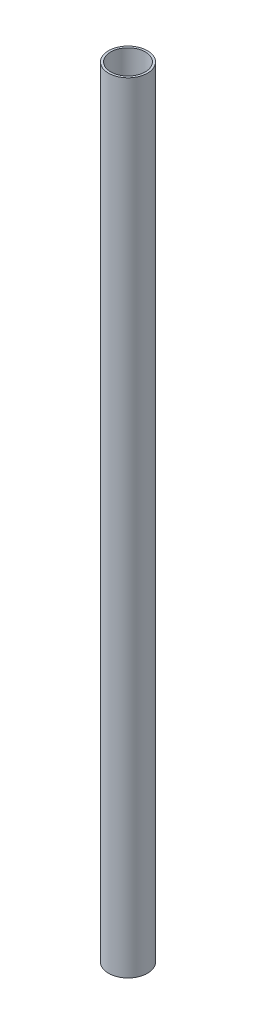
ISO-10303-21;
HEADER;
FILE_DESCRIPTION(('STEP AP214'),'2;1');
FILE_NAME('part.step','',(''),(''),'','','');
FILE_SCHEMA(('AUTOMOTIVE_DESIGN { 1 0 10303 214 1 1 1 1 }'));
ENDSEC;
DATA;
#1=APPLICATION_CONTEXT('core data for automotive mechanical design processes');
#2=APPLICATION_PROTOCOL_DEFINITION('international standard','automotive_design',2000,#1);
#3=PRODUCT_CONTEXT('',#1,'mechanical');
#4=PRODUCT('Part','Part','',(#3));
#5=PRODUCT_RELATED_PRODUCT_CATEGORY('part','',(#4));
#6=PRODUCT_DEFINITION_FORMATION('','',#4);
#7=PRODUCT_DEFINITION_CONTEXT('part definition',#1,'design');
#8=PRODUCT_DEFINITION('design','',#6,#7);
#9=PRODUCT_DEFINITION_SHAPE('','',#8);
#10=(LENGTH_UNIT() NAMED_UNIT(*) SI_UNIT(.MILLI.,.METRE.));
#11=(NAMED_UNIT(*) PLANE_ANGLE_UNIT() SI_UNIT($,.RADIAN.));
#12=(NAMED_UNIT(*) SI_UNIT($,.STERADIAN.) SOLID_ANGLE_UNIT());
#13=UNCERTAINTY_MEASURE_WITH_UNIT(LENGTH_MEASURE(1.E-05),#10,'distance_accuracy_value','');
#14=(GEOMETRIC_REPRESENTATION_CONTEXT(3) GLOBAL_UNCERTAINTY_ASSIGNED_CONTEXT((#13)) GLOBAL_UNIT_ASSIGNED_CONTEXT((#10,
#11,#12)) REPRESENTATION_CONTEXT('',''));
#15=CARTESIAN_POINT('',(0.,0.,0.));
#16=DIRECTION('',(0.,0.,1.));
#17=DIRECTION('',(1.,0.,0.));
#18=AXIS2_PLACEMENT_3D('',#15,#16,#17);
#19=CARTESIAN_POINT('',(0.,254.,0.));
#20=DIRECTION('',(0.,1.,0.));
#21=DIRECTION('',(0.,0.,1.));
#22=AXIS2_PLACEMENT_3D('',#19,#20,#21);
#23=PLANE('',#22);
#24=CARTESIAN_POINT('',(0.,254.,0.));
#25=DIRECTION('',(0.,1.,0.));
#26=DIRECTION('',(0.,0.,1.));
#27=AXIS2_PLACEMENT_3D('',#24,#25,#26);
#28=CIRCLE('',#27,6.35);
#29=CARTESIAN_POINT('',(0.,254.,6.35));
#30=VERTEX_POINT('',#29);
#31=EDGE_CURVE('E10',#30,#30,#28,.T.);
#32=ORIENTED_EDGE('',*,*,#31,.T.);
#33=EDGE_LOOP('',(#32));
#34=FACE_BOUND('',#33,.T.);
#35=CARTESIAN_POINT('',(0.,254.,0.));
#36=DIRECTION('',(0.,1.,0.));
#37=DIRECTION('',(0.,0.,1.));
#38=AXIS2_PLACEMENT_3D('',#35,#36,#37);
#39=CIRCLE('',#38,5.6388);
#40=CARTESIAN_POINT('',(0.,254.,5.6388));
#41=VERTEX_POINT('',#40);
#42=EDGE_CURVE('E42',#41,#41,#39,.T.);
#43=ORIENTED_EDGE('',*,*,#42,.F.);
#44=EDGE_LOOP('',(#43));
#45=FACE_BOUND('',#44,.T.);
#46=ADVANCED_FACE('F31',(#34,#45),#23,.T.);
#47=CARTESIAN_POINT('',(0.,0.,0.));
#48=DIRECTION('',(0.,1.,0.));
#49=DIRECTION('',(0.,0.,1.));
#50=AXIS2_PLACEMENT_3D('',#47,#48,#49);
#51=PLANE('',#50);
#52=CARTESIAN_POINT('',(0.,0.,0.));
#53=DIRECTION('',(0.,1.,0.));
#54=DIRECTION('',(0.,0.,1.));
#55=AXIS2_PLACEMENT_3D('',#52,#53,#54);
#56=CIRCLE('',#55,6.35);
#57=CARTESIAN_POINT('',(0.,0.,6.35));
#58=VERTEX_POINT('',#57);
#59=EDGE_CURVE('E35',#58,#58,#56,.T.);
#60=ORIENTED_EDGE('',*,*,#59,.F.);
#61=EDGE_LOOP('',(#60));
#62=FACE_BOUND('',#61,.T.);
#63=CARTESIAN_POINT('',(0.,0.,0.));
#64=DIRECTION('',(0.,1.,0.));
#65=DIRECTION('',(0.,0.,1.));
#66=AXIS2_PLACEMENT_3D('',#63,#64,#65);
#67=CIRCLE('',#66,5.6388);
#68=CARTESIAN_POINT('',(0.,0.,5.6388));
#69=VERTEX_POINT('',#68);
#70=EDGE_CURVE('E44',#69,#69,#67,.T.);
#71=ORIENTED_EDGE('',*,*,#70,.T.);
#72=EDGE_LOOP('',(#71));
#73=FACE_BOUND('',#72,.T.);
#74=ADVANCED_FACE('F54',(#62,#73),#51,.F.);
#75=CARTESIAN_POINT('',(0.,254.,0.));
#76=DIRECTION('',(0.,-1.,0.));
#77=DIRECTION('',(0.,0.,-1.));
#78=AXIS2_PLACEMENT_3D('',#75,#76,#77);
#79=CYLINDRICAL_SURFACE('',#78,6.35);
#80=ORIENTED_EDGE('',*,*,#31,.F.);
#81=EDGE_LOOP('',(#80));
#82=FACE_BOUND('',#81,.T.);
#83=ORIENTED_EDGE('',*,*,#59,.T.);
#84=EDGE_LOOP('',(#83));
#85=FACE_BOUND('',#84,.T.);
#86=ADVANCED_FACE('F33',(#82,#85),#79,.T.);
#87=CARTESIAN_POINT('',(0.,254.,0.));
#88=DIRECTION('',(0.,-1.,0.));
#89=DIRECTION('',(0.,0.,-1.));
#90=AXIS2_PLACEMENT_3D('',#87,#88,#89);
#91=CYLINDRICAL_SURFACE('',#90,5.6388);
#92=ORIENTED_EDGE('',*,*,#42,.T.);
#93=EDGE_LOOP('',(#92));
#94=FACE_BOUND('',#93,.T.);
#95=ORIENTED_EDGE('',*,*,#70,.F.);
#96=EDGE_LOOP('',(#95));
#97=FACE_BOUND('',#96,.T.);
#98=ADVANCED_FACE('F50',(#94,#97),#91,.F.);
#99=CLOSED_SHELL('',(#46,#74,#86,#98));
#100=MANIFOLD_SOLID_BREP('B2',#99);
#101=ADVANCED_BREP_SHAPE_REPRESENTATION('',(#18,#100),#14);
#102=SHAPE_DEFINITION_REPRESENTATION(#9,#101);
ENDSEC;
END-ISO-10303-21;
